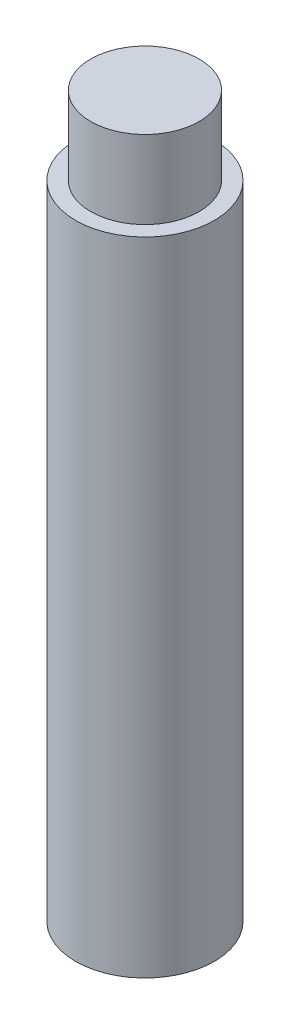
ISO-10303-21;
HEADER;
FILE_DESCRIPTION(('STEP AP214'),'2;1');
FILE_NAME('part.step','',(''),(''),'','','');
FILE_SCHEMA(('AUTOMOTIVE_DESIGN { 1 0 10303 214 1 1 1 1 }'));
ENDSEC;
DATA;
#1=APPLICATION_CONTEXT('core data for automotive mechanical design processes');
#2=APPLICATION_PROTOCOL_DEFINITION('international standard','automotive_design',2000,#1);
#3=PRODUCT_CONTEXT('',#1,'mechanical');
#4=PRODUCT('Part','Part','',(#3));
#5=PRODUCT_RELATED_PRODUCT_CATEGORY('part','',(#4));
#6=PRODUCT_DEFINITION_FORMATION('','',#4);
#7=PRODUCT_DEFINITION_CONTEXT('part definition',#1,'design');
#8=PRODUCT_DEFINITION('design','',#6,#7);
#9=PRODUCT_DEFINITION_SHAPE('','',#8);
#10=(LENGTH_UNIT() NAMED_UNIT(*) SI_UNIT(.MILLI.,.METRE.));
#11=(NAMED_UNIT(*) PLANE_ANGLE_UNIT() SI_UNIT($,.RADIAN.));
#12=(NAMED_UNIT(*) SI_UNIT($,.STERADIAN.) SOLID_ANGLE_UNIT());
#13=UNCERTAINTY_MEASURE_WITH_UNIT(LENGTH_MEASURE(1.E-05),#10,'distance_accuracy_value','');
#14=(GEOMETRIC_REPRESENTATION_CONTEXT(3) GLOBAL_UNCERTAINTY_ASSIGNED_CONTEXT((#13)) GLOBAL_UNIT_ASSIGNED_CONTEXT((#10,
#11,#12)) REPRESENTATION_CONTEXT('',''));
#15=CARTESIAN_POINT('',(0.,0.,0.));
#16=DIRECTION('',(0.,0.,1.));
#17=DIRECTION('',(1.,0.,0.));
#18=AXIS2_PLACEMENT_3D('',#15,#16,#17);
#19=CARTESIAN_POINT('',(0.,7.4,0.));
#20=DIRECTION('',(0.,-1.,0.));
#21=DIRECTION('',(0.,0.,-1.));
#22=AXIS2_PLACEMENT_3D('',#19,#20,#21);
#23=CYLINDRICAL_SURFACE('',#22,1.6);
#24=CARTESIAN_POINT('',(0.,7.4,0.));
#25=DIRECTION('',(0.,1.,0.));
#26=DIRECTION('',(0.,0.,1.));
#27=AXIS2_PLACEMENT_3D('',#24,#25,#26);
#28=CIRCLE('',#27,1.6);
#29=CARTESIAN_POINT('',(0.,7.4,1.6));
#30=VERTEX_POINT('',#29);
#31=EDGE_CURVE('E10',#30,#30,#28,.T.);
#32=ORIENTED_EDGE('',*,*,#31,.F.);
#33=EDGE_LOOP('',(#32));
#34=FACE_BOUND('',#33,.T.);
#35=CARTESIAN_POINT('',(0.,-7.4,0.));
#36=DIRECTION('',(0.,1.,0.));
#37=DIRECTION('',(0.,0.,1.));
#38=AXIS2_PLACEMENT_3D('',#35,#36,#37);
#39=CIRCLE('',#38,1.6);
#40=CARTESIAN_POINT('',(0.,-7.4,1.6));
#41=VERTEX_POINT('',#40);
#42=EDGE_CURVE('E36',#41,#41,#39,.T.);
#43=ORIENTED_EDGE('',*,*,#42,.T.);
#44=EDGE_LOOP('',(#43));
#45=FACE_BOUND('',#44,.T.);
#46=ADVANCED_FACE('F33',(#34,#45),#23,.T.);
#47=CARTESIAN_POINT('',(0.,7.4,0.));
#48=DIRECTION('',(0.,1.,0.));
#49=DIRECTION('',(0.,0.,1.));
#50=AXIS2_PLACEMENT_3D('',#47,#48,#49);
#51=PLANE('',#50);
#52=CARTESIAN_POINT('',(0.,7.4,0.));
#53=DIRECTION('',(0.,1.,0.));
#54=DIRECTION('',(0.,0.,1.));
#55=AXIS2_PLACEMENT_3D('',#52,#53,#54);
#56=CIRCLE('',#55,1.25);
#57=CARTESIAN_POINT('',(0.,7.4,1.25));
#58=VERTEX_POINT('',#57);
#59=EDGE_CURVE('E45',#58,#58,#56,.T.);
#60=ORIENTED_EDGE('',*,*,#59,.F.);
#61=EDGE_LOOP('',(#60));
#62=FACE_BOUND('',#61,.T.);
#63=ORIENTED_EDGE('',*,*,#31,.T.);
#64=EDGE_LOOP('',(#63));
#65=FACE_BOUND('',#64,.T.);
#66=ADVANCED_FACE('F60',(#62,#65),#51,.T.);
#67=CARTESIAN_POINT('',(0.,-7.4,0.));
#68=DIRECTION('',(0.,1.,0.));
#69=DIRECTION('',(0.,0.,1.));
#70=AXIS2_PLACEMENT_3D('',#67,#68,#69);
#71=PLANE('',#70);
#72=ORIENTED_EDGE('',*,*,#42,.F.);
#73=EDGE_LOOP('',(#72));
#74=FACE_BOUND('',#73,.T.);
#75=ADVANCED_FACE('F56',(#74),#71,.F.);
#76=CARTESIAN_POINT('',(0.,9.2,0.));
#77=DIRECTION('',(0.,-1.,0.));
#78=DIRECTION('',(0.,0.,-1.));
#79=AXIS2_PLACEMENT_3D('',#76,#77,#78);
#80=CYLINDRICAL_SURFACE('',#79,1.25);
#81=CARTESIAN_POINT('',(0.,9.2,0.));
#82=DIRECTION('',(0.,1.,0.));
#83=DIRECTION('',(0.,0.,1.));
#84=AXIS2_PLACEMENT_3D('',#81,#82,#83);
#85=CIRCLE('',#84,1.25);
#86=CARTESIAN_POINT('',(0.,9.2,1.25));
#87=VERTEX_POINT('',#86);
#88=EDGE_CURVE('E43',#87,#87,#85,.T.);
#89=ORIENTED_EDGE('',*,*,#88,.F.);
#90=EDGE_LOOP('',(#89));
#91=FACE_BOUND('',#90,.T.);
#92=ORIENTED_EDGE('',*,*,#59,.T.);
#93=EDGE_LOOP('',(#92));
#94=FACE_BOUND('',#93,.T.);
#95=ADVANCED_FACE('F53',(#91,#94),#80,.T.);
#96=CARTESIAN_POINT('',(0.,9.2,0.));
#97=DIRECTION('',(0.,1.,0.));
#98=DIRECTION('',(0.,0.,1.));
#99=AXIS2_PLACEMENT_3D('',#96,#97,#98);
#100=PLANE('',#99);
#101=ORIENTED_EDGE('',*,*,#88,.T.);
#102=EDGE_LOOP('',(#101));
#103=FACE_BOUND('',#102,.T.);
#104=ADVANCED_FACE('F51',(#103),#100,.T.);
#105=CLOSED_SHELL('',(#46,#66,#75,#95,#104));
#106=MANIFOLD_SOLID_BREP('B2',#105);
#107=ADVANCED_BREP_SHAPE_REPRESENTATION('',(#18,#106),#14);
#108=SHAPE_DEFINITION_REPRESENTATION(#9,#107);
ENDSEC;
END-ISO-10303-21;
